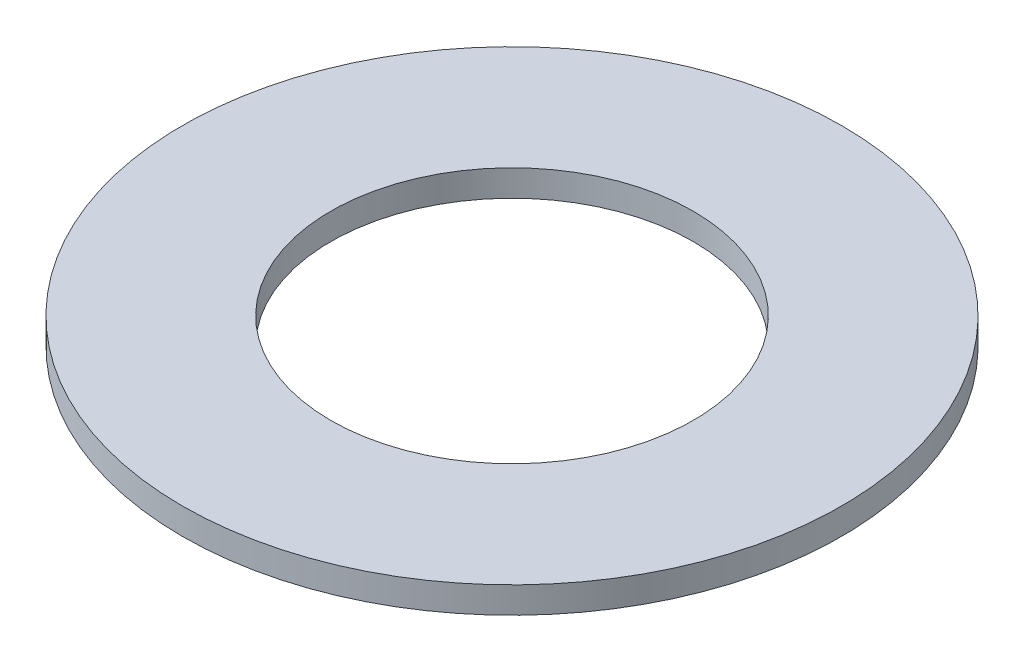
ISO-10303-21;
HEADER;
FILE_DESCRIPTION(('STEP AP214'),'2;1');
FILE_NAME('part.step','',(''),(''),'','','');
FILE_SCHEMA(('AUTOMOTIVE_DESIGN { 1 0 10303 214 1 1 1 1 }'));
ENDSEC;
DATA;
#1=APPLICATION_CONTEXT('core data for automotive mechanical design processes');
#2=APPLICATION_PROTOCOL_DEFINITION('international standard','automotive_design',2000,#1);
#3=PRODUCT_CONTEXT('',#1,'mechanical');
#4=PRODUCT('Part','Part','',(#3));
#5=PRODUCT_RELATED_PRODUCT_CATEGORY('part','',(#4));
#6=PRODUCT_DEFINITION_FORMATION('','',#4);
#7=PRODUCT_DEFINITION_CONTEXT('part definition',#1,'design');
#8=PRODUCT_DEFINITION('design','',#6,#7);
#9=PRODUCT_DEFINITION_SHAPE('','',#8);
#10=(LENGTH_UNIT() NAMED_UNIT(*) SI_UNIT(.MILLI.,.METRE.));
#11=(NAMED_UNIT(*) PLANE_ANGLE_UNIT() SI_UNIT($,.RADIAN.));
#12=(NAMED_UNIT(*) SI_UNIT($,.STERADIAN.) SOLID_ANGLE_UNIT());
#13=UNCERTAINTY_MEASURE_WITH_UNIT(LENGTH_MEASURE(1.E-05),#10,'distance_accuracy_value','');
#14=(GEOMETRIC_REPRESENTATION_CONTEXT(3) GLOBAL_UNCERTAINTY_ASSIGNED_CONTEXT((#13)) GLOBAL_UNIT_ASSIGNED_CONTEXT((#10,
#11,#12)) REPRESENTATION_CONTEXT('',''));
#15=CARTESIAN_POINT('',(0.,0.,0.));
#16=DIRECTION('',(0.,0.,1.));
#17=DIRECTION('',(1.,0.,0.));
#18=AXIS2_PLACEMENT_3D('',#15,#16,#17);
#19=CARTESIAN_POINT('',(0.,4.,0.));
#20=DIRECTION('',(0.,-1.,0.));
#21=DIRECTION('',(0.,0.,-1.));
#22=AXIS2_PLACEMENT_3D('',#19,#20,#21);
#23=CYLINDRICAL_SURFACE('',#22,50.);
#24=CARTESIAN_POINT('',(0.,4.,0.));
#25=DIRECTION('',(0.,1.,0.));
#26=DIRECTION('',(0.,0.,1.));
#27=AXIS2_PLACEMENT_3D('',#24,#25,#26);
#28=CIRCLE('',#27,50.);
#29=CARTESIAN_POINT('',(0.,4.,50.));
#30=VERTEX_POINT('',#29);
#31=EDGE_CURVE('E10',#30,#30,#28,.T.);
#32=ORIENTED_EDGE('',*,*,#31,.F.);
#33=EDGE_LOOP('',(#32));
#34=FACE_BOUND('',#33,.T.);
#35=CARTESIAN_POINT('',(0.,0.,0.));
#36=DIRECTION('',(0.,1.,0.));
#37=DIRECTION('',(0.,0.,1.));
#38=AXIS2_PLACEMENT_3D('',#35,#36,#37);
#39=CIRCLE('',#38,50.);
#40=CARTESIAN_POINT('',(0.,0.,50.));
#41=VERTEX_POINT('',#40);
#42=EDGE_CURVE('E37',#41,#41,#39,.T.);
#43=ORIENTED_EDGE('',*,*,#42,.T.);
#44=EDGE_LOOP('',(#43));
#45=FACE_BOUND('',#44,.T.);
#46=ADVANCED_FACE('F40',(#34,#45),#23,.T.);
#47=CARTESIAN_POINT('',(0.,4.,0.));
#48=DIRECTION('',(0.,1.,0.));
#49=DIRECTION('',(0.,0.,1.));
#50=AXIS2_PLACEMENT_3D('',#47,#48,#49);
#51=PLANE('',#50);
#52=CARTESIAN_POINT('',(0.,4.,0.));
#53=DIRECTION('',(0.,1.,0.));
#54=DIRECTION('',(0.,0.,1.));
#55=AXIS2_PLACEMENT_3D('',#52,#53,#54);
#56=CIRCLE('',#55,27.5);
#57=CARTESIAN_POINT('',(0.,4.,27.5));
#58=VERTEX_POINT('',#57);
#59=EDGE_CURVE('E50',#58,#58,#56,.T.);
#60=ORIENTED_EDGE('',*,*,#59,.F.);
#61=EDGE_LOOP('',(#60));
#62=FACE_BOUND('',#61,.T.);
#63=ORIENTED_EDGE('',*,*,#31,.T.);
#64=EDGE_LOOP('',(#63));
#65=FACE_BOUND('',#64,.T.);
#66=ADVANCED_FACE('F59',(#62,#65),#51,.T.);
#67=CARTESIAN_POINT('',(0.,0.,0.));
#68=DIRECTION('',(0.,1.,0.));
#69=DIRECTION('',(0.,0.,1.));
#70=AXIS2_PLACEMENT_3D('',#67,#68,#69);
#71=PLANE('',#70);
#72=CARTESIAN_POINT('',(0.,0.,0.));
#73=DIRECTION('',(0.,1.,0.));
#74=DIRECTION('',(0.,0.,1.));
#75=AXIS2_PLACEMENT_3D('',#72,#73,#74);
#76=CIRCLE('',#75,27.5);
#77=CARTESIAN_POINT('',(0.,0.,27.5));
#78=VERTEX_POINT('',#77);
#79=EDGE_CURVE('E47',#78,#78,#76,.T.);
#80=ORIENTED_EDGE('',*,*,#79,.T.);
#81=EDGE_LOOP('',(#80));
#82=FACE_BOUND('',#81,.T.);
#83=ORIENTED_EDGE('',*,*,#42,.F.);
#84=EDGE_LOOP('',(#83));
#85=FACE_BOUND('',#84,.T.);
#86=ADVANCED_FACE('F58',(#82,#85),#71,.F.);
#87=CARTESIAN_POINT('',(0.,4.,0.));
#88=DIRECTION('',(0.,-1.,0.));
#89=DIRECTION('',(0.,0.,-1.));
#90=AXIS2_PLACEMENT_3D('',#87,#88,#89);
#91=CYLINDRICAL_SURFACE('',#90,27.5);
#92=ORIENTED_EDGE('',*,*,#59,.T.);
#93=EDGE_LOOP('',(#92));
#94=FACE_BOUND('',#93,.T.);
#95=ORIENTED_EDGE('',*,*,#79,.F.);
#96=EDGE_LOOP('',(#95));
#97=FACE_BOUND('',#96,.T.);
#98=ADVANCED_FACE('F54',(#94,#97),#91,.F.);
#99=CLOSED_SHELL('',(#46,#66,#86,#98));
#100=MANIFOLD_SOLID_BREP('B2',#99);
#101=ADVANCED_BREP_SHAPE_REPRESENTATION('',(#18,#100),#14);
#102=SHAPE_DEFINITION_REPRESENTATION(#9,#101);
ENDSEC;
END-ISO-10303-21;
